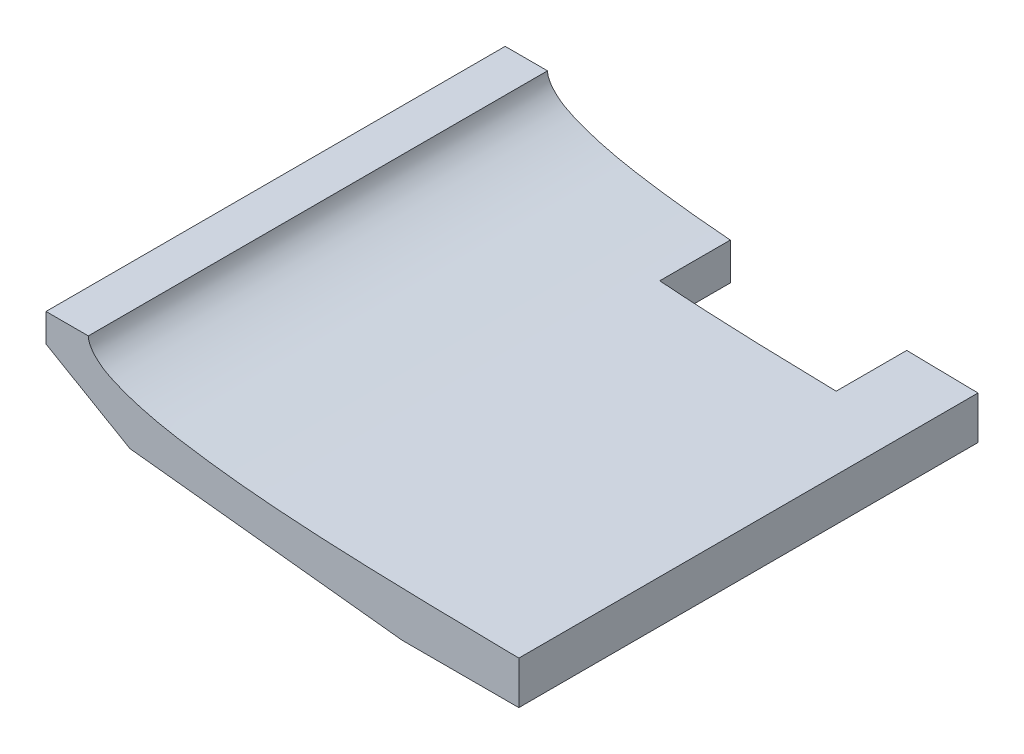
ISO-10303-21;
HEADER;
FILE_DESCRIPTION(('STEP AP214'),'2;1');
FILE_NAME('part.step','',(''),(''),'','','');
FILE_SCHEMA(('AUTOMOTIVE_DESIGN { 1 0 10303 214 1 1 1 1 }'));
ENDSEC;
DATA;
#1=APPLICATION_CONTEXT('core data for automotive mechanical design processes');
#2=APPLICATION_PROTOCOL_DEFINITION('international standard','automotive_design',2000,#1);
#3=PRODUCT_CONTEXT('',#1,'mechanical');
#4=PRODUCT('Part','Part','',(#3));
#5=PRODUCT_RELATED_PRODUCT_CATEGORY('part','',(#4));
#6=PRODUCT_DEFINITION_FORMATION('','',#4);
#7=PRODUCT_DEFINITION_CONTEXT('part definition',#1,'design');
#8=PRODUCT_DEFINITION('design','',#6,#7);
#9=PRODUCT_DEFINITION_SHAPE('','',#8);
#10=(LENGTH_UNIT() NAMED_UNIT(*) SI_UNIT(.MILLI.,.METRE.));
#11=(NAMED_UNIT(*) PLANE_ANGLE_UNIT() SI_UNIT($,.RADIAN.));
#12=(NAMED_UNIT(*) SI_UNIT($,.STERADIAN.) SOLID_ANGLE_UNIT());
#13=UNCERTAINTY_MEASURE_WITH_UNIT(LENGTH_MEASURE(1.E-05),#10,'distance_accuracy_value','');
#14=(GEOMETRIC_REPRESENTATION_CONTEXT(3) GLOBAL_UNCERTAINTY_ASSIGNED_CONTEXT((#13)) GLOBAL_UNIT_ASSIGNED_CONTEXT((#10,
#11,#12)) REPRESENTATION_CONTEXT('',''));
#15=CARTESIAN_POINT('',(0.,0.,0.));
#16=DIRECTION('',(0.,0.,1.));
#17=DIRECTION('',(1.,0.,0.));
#18=AXIS2_PLACEMENT_3D('',#15,#16,#17);
#19=CARTESIAN_POINT('',(0.,0.,-205.14));
#20=DIRECTION('',(0.,0.,1.));
#21=DIRECTION('',(1.,0.,0.));
#22=AXIS2_PLACEMENT_3D('',#19,#20,#21);
#23=PLANE('',#22);
#24=DIRECTION('',(-1.,0.,0.));
#25=VECTOR('',#24,1.);
#26=CARTESIAN_POINT('',(148.930235791546,-23.8936602432745,-205.14));
#27=LINE('',#26,#25);
#28=CARTESIAN_POINT('',(122.012987748225,-23.8936602432745,-205.139999999972));
#29=VERTEX_POINT('',#28);
#30=CARTESIAN_POINT('',(88.9302357915457,-23.8936602432745,-205.14));
#31=VERTEX_POINT('',#30);
#32=EDGE_CURVE('E152',#29,#31,#27,.T.);
#33=ORIENTED_EDGE('',*,*,#32,.F.);
#34=DIRECTION('',(0.,-1.,0.));
#35=VECTOR('',#34,1.);
#36=CARTESIAN_POINT('',(122.012987748225,0.,-205.14));
#37=LINE('',#36,#35);
#38=CARTESIAN_POINT('',(122.012987748225,-11.727641338036,-205.139999999972));
#39=VERTEX_POINT('',#38);
#40=EDGE_CURVE('E149',#39,#29,#37,.T.);
#41=ORIENTED_EDGE('',*,*,#40,.F.);
#42=CARTESIAN_POINT('',(222.012987748224,-11.2872773614074,-205.14));
#43=CARTESIAN_POINT('',(218.919378665289,-11.3223973767478,-205.14));
#44=CARTESIAN_POINT('',(205.647401932604,-11.467959012407,-205.14));
#45=CARTESIAN_POINT('',(182.199512526804,-11.713706477298,-205.14));
#46=CARTESIAN_POINT('',(151.674497926263,-11.9621131380845,-205.14));
#47=CARTESIAN_POINT('',(121.162418160369,-11.7895754768441,-205.14));
#48=CARTESIAN_POINT('',(95.7513309345537,-11.2827016840826,-205.14));
#49=CARTESIAN_POINT('',(75.4345455748465,-10.6804028674471,-205.14));
#50=CARTESIAN_POINT('',(60.2097930463776,-9.94096056040862,-205.14));
#51=CARTESIAN_POINT('',(44.9946268760517,-8.80564765903787,-205.14));
#52=CARTESIAN_POINT('',(32.3529914161165,-7.2837069255278,-205.14));
#53=CARTESIAN_POINT('',(22.2477539606058,-5.63338955843548,-205.14));
#54=CARTESIAN_POINT('',(14.6666085762918,-3.9200239548407,-205.14));
#55=CARTESIAN_POINT('',(8.28802407863243,-1.74749382065163,-205.14));
#56=CARTESIAN_POINT('',(2.90931259967548,0.956364700460667,-205.14));
#57=CARTESIAN_POINT('',(-1.89672620175331,6.52309669841284,-205.14));
#58=CARTESIAN_POINT('',(3.30662672053229,12.3039979945625,-205.14));
#59=CARTESIAN_POINT('',(9.09601436595202,15.5028984571257,-205.14));
#60=CARTESIAN_POINT('',(15.7472415942778,18.0443175722951,-205.14));
#61=CARTESIAN_POINT('',(23.5496671131226,20.117144312983,-205.14));
#62=CARTESIAN_POINT('',(33.8131815469566,22.3100945885303,-205.14));
#63=CARTESIAN_POINT('',(46.6352298566183,24.0543554633795,-205.14));
#64=CARTESIAN_POINT('',(61.9933352536892,25.2148612571156,-205.14));
#65=CARTESIAN_POINT('',(77.2950113671835,25.6577224294329,-205.14));
#66=CARTESIAN_POINT('',(97.6391657162876,25.4475340689814,-205.14));
#67=CARTESIAN_POINT('',(123.024226631959,23.8278748307742,-205.14));
#68=CARTESIAN_POINT('',(153.375544596371,20.4498563865987,-205.14));
#69=CARTESIAN_POINT('',(183.689332827867,16.2123042667402,-205.14));
#70=CARTESIAN_POINT('',(206.541071450016,12.2763423304222,-205.14));
#71=CARTESIAN_POINT('',(219.305332632429,9.88286237214647,-205.14));
#72=CARTESIAN_POINT('',(222.012987748224,9.36643436036431,-205.14));
#73=B_SPLINE_CURVE_WITH_KNOTS('',3,(#42,#43,#44,#45,#46,#47,#48,#49,#50,#51,#52,#53,#54,#55,#56,
#57,#58,#59,#60,#61,#62,#63,#64,#65,#66,#67,#68,#69,#70,#71,#72),.UNSPECIFIED.,.F.,.F.,(4,1,1,1,
1,1,1,1,1,1,1,1,1,1,1,1,1,1,1,1,1,1,1,1,1,1,1,1,4),(0.135902519716628,0.150834774390607,
0.199963506565112,0.249080491590112,0.298166920869625,0.347226598260492,0.371748790283378,
0.39626612837323,0.42079170287225,0.445368985882971,0.457709830972341,0.470165482504991,
0.482949879419857,0.489791740716257,0.49994201682548,0.512136749797248,0.519521461450315,
0.532994464684655,0.545911051204923,0.558602295103549,0.583586074296184,0.608309666465215,
0.632909244550233,0.657448148326611,0.706484295518651,0.755595699663312,0.804819773504179,
0.854194550210178,0.867498350403516),.UNSPECIFIED.);
#74=CARTESIAN_POINT('',(0.000798183001934805,6.34990742723156,-205.14));
#75=VERTEX_POINT('',#74);
#76=EDGE_CURVE('E147',#75,#39,#73,.F.);
#77=ORIENTED_EDGE('',*,*,#76,.F.);
#78=DIRECTION('',(-1.,0.,0.));
#79=VECTOR('',#78,1.);
#80=CARTESIAN_POINT('',(-11.9992018169981,6.34990742723155,-205.14));
#81=LINE('',#80,#79);
#82=CARTESIAN_POINT('',(-11.9992018169981,6.34990742723155,-205.14));
#83=VERTEX_POINT('',#82);
#84=EDGE_CURVE('E128',#75,#83,#81,.T.);
#85=ORIENTED_EDGE('',*,*,#84,.T.);
#86=DIRECTION('',(0.,1.,0.));
#87=VECTOR('',#86,1.);
#88=CARTESIAN_POINT('',(-11.9992018169981,6.34990742723155,-205.14));
#89=LINE('',#88,#87);
#90=CARTESIAN_POINT('',(-11.9992018169981,-1.65009257276845,-205.14));
#91=VERTEX_POINT('',#90);
#92=EDGE_CURVE('E136',#91,#83,#89,.T.);
#93=ORIENTED_EDGE('',*,*,#92,.F.);
#94=DIRECTION('',(-0.865252469584672,0.501336377971545,0.));
#95=VECTOR('',#94,1.);
#96=CARTESIAN_POINT('',(-11.9992018169981,-1.65009257276845,-205.14));
#97=LINE('',#96,#95);
#98=CARTESIAN_POINT('',(11.7824923751169,-15.4294562237324,-205.14));
#99=VERTEX_POINT('',#98);
#100=EDGE_CURVE('E143',#99,#91,#97,.T.);
#101=ORIENTED_EDGE('',*,*,#100,.F.);
#102=DIRECTION('',(-0.99403519167725,0.10905978959806,0.));
#103=VECTOR('',#102,1.);
#104=CARTESIAN_POINT('',(88.9302357915457,-23.8936602432745,-205.14));
#105=LINE('',#104,#103);
#106=EDGE_CURVE('E211',#31,#99,#105,.T.);
#107=ORIENTED_EDGE('',*,*,#106,.F.);
#108=EDGE_LOOP('',(#33,#41,#77,#85,#93,#101,#107));
#109=FACE_BOUND('',#108,.T.);
#110=ADVANCED_FACE('F40',(#109),#23,.T.);
#111=CARTESIAN_POINT('',(122.012987748225,0.,0.));
#112=DIRECTION('',(1.,0.,0.));
#113=DIRECTION('',(0.,0.,-1.));
#114=AXIS2_PLACEMENT_3D('',#111,#112,#113);
#115=PLANE('',#114);
#116=DIRECTION('',(0.,0.,1.));
#117=VECTOR('',#116,1.);
#118=CARTESIAN_POINT('',(122.012987748225,-23.8936602432745,-577.230552036248));
#119=LINE('',#118,#117);
#120=CARTESIAN_POINT('',(122.012987748225,-23.8936602432745,-335.28));
#121=VERTEX_POINT('',#120);
#122=EDGE_CURVE('E216',#121,#29,#119,.T.);
#123=ORIENTED_EDGE('',*,*,#122,.F.);
#124=DIRECTION('',(0.,-1.,0.));
#125=VECTOR('',#124,1.);
#126=CARTESIAN_POINT('',(122.012987748225,0.,-335.28));
#127=LINE('',#126,#125);
#128=CARTESIAN_POINT('',(122.012987748225,-11.727641338036,-335.28));
#129=VERTEX_POINT('',#128);
#130=EDGE_CURVE('E148',#129,#121,#127,.T.);
#131=ORIENTED_EDGE('',*,*,#130,.F.);
#132=DIRECTION('',(0.,0.,1.));
#133=VECTOR('',#132,1.);
#134=CARTESIAN_POINT('',(122.012987748225,-11.727641338036,-205.14));
#135=LINE('',#134,#133);
#136=EDGE_CURVE('E208',#39,#129,#135,.F.);
#137=ORIENTED_EDGE('',*,*,#136,.F.);
#138=ORIENTED_EDGE('',*,*,#40,.T.);
#139=EDGE_LOOP('',(#123,#131,#137,#138));
#140=FACE_BOUND('',#139,.T.);
#141=ADVANCED_FACE('F232',(#140),#115,.T.);
#142=CARTESIAN_POINT('',(148.930235791546,-23.8936602432745,-577.230552036248));
#143=DIRECTION('',(0.,-1.,0.));
#144=DIRECTION('',(0.,0.,-1.));
#145=AXIS2_PLACEMENT_3D('',#142,#143,#144);
#146=PLANE('',#145);
#147=ORIENTED_EDGE('',*,*,#122,.T.);
#148=ORIENTED_EDGE('',*,*,#32,.T.);
#149=DIRECTION('',(0.,0.,1.));
#150=VECTOR('',#149,1.);
#151=CARTESIAN_POINT('',(88.9302357915457,-23.8936602432745,-577.230552036248));
#152=LINE('',#151,#150);
#153=CARTESIAN_POINT('',(88.9302357915457,-23.8936602432745,-315.279999999985));
#154=VERTEX_POINT('',#153);
#155=EDGE_CURVE('E159',#154,#31,#152,.T.);
#156=ORIENTED_EDGE('',*,*,#155,.F.);
#157=DIRECTION('',(1.,0.,0.));
#158=VECTOR('',#157,1.);
#159=CARTESIAN_POINT('',(148.930235791546,-23.8936602432745,-315.279999999985));
#160=LINE('',#159,#158);
#161=CARTESIAN_POINT('',(101.81078010371,-23.8936602432745,-315.279999999985));
#162=VERTEX_POINT('',#161);
#163=EDGE_CURVE('E195',#154,#162,#160,.T.);
#164=ORIENTED_EDGE('',*,*,#163,.T.);
#165=DIRECTION('',(0.,0.,1.));
#166=VECTOR('',#165,1.);
#167=CARTESIAN_POINT('',(101.81078010371,-23.8936602432745,-577.230552036248));
#168=LINE('',#167,#166);
#169=CARTESIAN_POINT('',(101.81078010371,-23.8936602432745,-335.28));
#170=VERTEX_POINT('',#169);
#171=EDGE_CURVE('E142',#170,#162,#168,.T.);
#172=ORIENTED_EDGE('',*,*,#171,.F.);
#173=DIRECTION('',(1.,0.,0.));
#174=VECTOR('',#173,1.);
#175=CARTESIAN_POINT('',(148.930235791546,-23.8936602432745,-335.28));
#176=LINE('',#175,#174);
#177=EDGE_CURVE('E163',#170,#121,#176,.T.);
#178=ORIENTED_EDGE('',*,*,#177,.T.);
#179=EDGE_LOOP('',(#147,#148,#156,#164,#172,#178));
#180=FACE_BOUND('',#179,.T.);
#181=ADVANCED_FACE('F245',(#180),#146,.T.);
#182=CARTESIAN_POINT('',(51.8107801037102,-18.1594098063785,-315.28));
#183=DIRECTION('',(-1.,0.,0.));
#184=DIRECTION('',(0.,0.,1.));
#185=AXIS2_PLACEMENT_3D('',#182,#183,#184);
#186=PLANE('',#185);
#187=DIRECTION('',(0.,0.,1.));
#188=VECTOR('',#187,1.);
#189=CARTESIAN_POINT('',(51.8107801037102,-9.28886109713478,-205.14));
#190=LINE('',#189,#188);
#191=CARTESIAN_POINT('',(51.8107801037102,-9.28886109713478,-335.28));
#192=VERTEX_POINT('',#191);
#193=CARTESIAN_POINT('',(51.8107801037102,-9.28886109713478,-315.279999999985));
#194=VERTEX_POINT('',#193);
#195=EDGE_CURVE('E59',#192,#194,#190,.T.);
#196=ORIENTED_EDGE('',*,*,#195,.T.);
#197=DIRECTION('',(0.,1.,0.));
#198=VECTOR('',#197,1.);
#199=CARTESIAN_POINT('',(51.8107801037102,56.8346247025372,-315.279999999985));
#200=LINE('',#199,#198);
#201=CARTESIAN_POINT('',(51.8107801037102,-19.821128343796,-315.279999999985));
#202=VERTEX_POINT('',#201);
#203=EDGE_CURVE('E202',#202,#194,#200,.T.);
#204=ORIENTED_EDGE('',*,*,#203,.F.);
#205=DIRECTION('',(0.,0.,-1.));
#206=VECTOR('',#205,1.);
#207=CARTESIAN_POINT('',(51.8107801037102,-19.821128343796,-577.230552036248));
#208=LINE('',#207,#206);
#209=CARTESIAN_POINT('',(51.8107801037102,-19.821128343796,-335.28));
#210=VERTEX_POINT('',#209);
#211=EDGE_CURVE('E174',#202,#210,#208,.T.);
#212=ORIENTED_EDGE('',*,*,#211,.T.);
#213=DIRECTION('',(0.,-1.,0.));
#214=VECTOR('',#213,1.);
#215=CARTESIAN_POINT('',(51.8107801037102,-43.1653752974628,-335.28));
#216=LINE('',#215,#214);
#217=EDGE_CURVE('E64',#192,#210,#216,.T.);
#218=ORIENTED_EDGE('',*,*,#217,.F.);
#219=EDGE_LOOP('',(#196,#204,#212,#218));
#220=FACE_BOUND('',#219,.T.);
#221=ADVANCED_FACE('F260',(#220),#186,.F.);
#222=CARTESIAN_POINT('',(-50.1696101681485,56.8346247025372,-315.279999999985));
#223=DIRECTION('',(0.,0.,-1.));
#224=DIRECTION('',(0.,1.,0.));
#225=AXIS2_PLACEMENT_3D('',#222,#223,#224);
#226=PLANE('',#225);
#227=DIRECTION('',(0.,1.,0.));
#228=VECTOR('',#227,1.);
#229=CARTESIAN_POINT('',(101.81078010371,56.8346247025372,-315.279999999985));
#230=LINE('',#229,#228);
#231=CARTESIAN_POINT('',(101.81078010371,-11.3832380593149,-315.279999999985));
#232=VERTEX_POINT('',#231);
#233=EDGE_CURVE('E51',#162,#232,#230,.T.);
#234=ORIENTED_EDGE('',*,*,#233,.F.);
#235=ORIENTED_EDGE('',*,*,#163,.F.);
#236=DIRECTION('',(0.99403519167725,-0.10905978959806,0.));
#237=VECTOR('',#236,1.);
#238=CARTESIAN_POINT('',(88.9302357915456,-23.8936602432745,-315.279999999985));
#239=LINE('',#238,#237);
#240=EDGE_CURVE('E176',#202,#154,#239,.T.);
#241=ORIENTED_EDGE('',*,*,#240,.F.);
#242=ORIENTED_EDGE('',*,*,#203,.T.);
#243=CARTESIAN_POINT('',(222.012987748224,-11.2872773614074,-315.279999999985));
#244=CARTESIAN_POINT('',(218.919378665289,-11.3223973767478,-315.279999999985));
#245=CARTESIAN_POINT('',(205.647401932604,-11.467959012407,-315.279999999985));
#246=CARTESIAN_POINT('',(182.199512526804,-11.713706477298,-315.279999999985));
#247=CARTESIAN_POINT('',(151.674497926263,-11.9621131380845,-315.279999999985));
#248=CARTESIAN_POINT('',(121.162418160369,-11.7895754768441,-315.279999999985));
#249=CARTESIAN_POINT('',(95.7513309345537,-11.2827016840826,-315.279999999985));
#250=CARTESIAN_POINT('',(75.4345455748465,-10.6804028674471,-315.279999999985));
#251=CARTESIAN_POINT('',(60.2097930463776,-9.94096056040862,-315.279999999985));
#252=CARTESIAN_POINT('',(44.9946268760517,-8.80564765903787,-315.279999999985));
#253=CARTESIAN_POINT('',(32.3529914161165,-7.2837069255278,-315.279999999985));
#254=CARTESIAN_POINT('',(22.2477539606058,-5.63338955843548,-315.279999999985));
#255=CARTESIAN_POINT('',(14.6666085762918,-3.9200239548407,-315.279999999985));
#256=CARTESIAN_POINT('',(8.28802407863243,-1.74749382065163,-315.279999999985));
#257=CARTESIAN_POINT('',(2.90931259967548,0.956364700460667,-315.279999999985));
#258=CARTESIAN_POINT('',(-1.89672620175331,6.52309669841284,-315.279999999985));
#259=CARTESIAN_POINT('',(3.30662672053229,12.3039979945625,-315.279999999985));
#260=CARTESIAN_POINT('',(9.09601436595202,15.5028984571257,-315.279999999985));
#261=CARTESIAN_POINT('',(15.7472415942778,18.0443175722951,-315.279999999985));
#262=CARTESIAN_POINT('',(23.5496671131226,20.117144312983,-315.279999999985));
#263=CARTESIAN_POINT('',(33.8131815469566,22.3100945885303,-315.279999999985));
#264=CARTESIAN_POINT('',(46.6352298566183,24.0543554633795,-315.279999999985));
#265=CARTESIAN_POINT('',(61.9933352536892,25.2148612571156,-315.279999999985));
#266=CARTESIAN_POINT('',(77.2950113671835,25.6577224294329,-315.279999999985));
#267=CARTESIAN_POINT('',(97.6391657162876,25.4475340689814,-315.279999999985));
#268=CARTESIAN_POINT('',(123.024226631959,23.8278748307742,-315.279999999985));
#269=CARTESIAN_POINT('',(153.375544596371,20.4498563865987,-315.279999999985));
#270=CARTESIAN_POINT('',(183.689332827867,16.2123042667402,-315.279999999985));
#271=CARTESIAN_POINT('',(206.541071450016,12.2763423304222,-315.279999999985));
#272=CARTESIAN_POINT('',(219.305332632429,9.88286237214647,-315.279999999985));
#273=CARTESIAN_POINT('',(222.012987748224,9.36643436036431,-315.279999999985));
#274=B_SPLINE_CURVE_WITH_KNOTS('',3,(#243,#244,#245,#246,#247,#248,#249,#250,#251,#252,#253,
#254,#255,#256,#257,#258,#259,#260,#261,#262,#263,#264,#265,#266,#267,#268,#269,#270,#271,#272,
#273),.UNSPECIFIED.,.F.,.F.,(4,1,1,1,1,1,1,1,1,1,1,1,1,1,1,1,1,1,1,1,1,1,1,1,1,1,1,1,4),
(0.135902519716628,0.150834774390607,0.199963506565112,0.249080491590112,0.298166920869625,
0.347226598260492,0.371748790283378,0.39626612837323,0.42079170287225,0.445368985882971,
0.457709830972341,0.470165482504991,0.482949879419857,0.489791740716257,0.49994201682548,
0.512136749797248,0.519521461450315,0.532994464684655,0.545911051204923,0.558602295103549,
0.583586074296184,0.608309666465215,0.632909244550233,0.657448148326611,0.706484295518651,
0.755595699663312,0.804819773504179,0.854194550210178,0.867498350403516),.UNSPECIFIED.);
#275=EDGE_CURVE('E190',#232,#194,#274,.T.);
#276=ORIENTED_EDGE('',*,*,#275,.F.);
#277=EDGE_LOOP('',(#234,#235,#241,#242,#276));
#278=FACE_BOUND('',#277,.T.);
#279=ADVANCED_FACE('F251',(#278),#226,.T.);
#280=CARTESIAN_POINT('',(101.81078010371,0.,0.));
#281=DIRECTION('',(1.,0.,0.));
#282=DIRECTION('',(0.,0.,-1.));
#283=AXIS2_PLACEMENT_3D('',#280,#281,#282);
#284=PLANE('',#283);
#285=DIRECTION('',(0.,0.,1.));
#286=VECTOR('',#285,1.);
#287=CARTESIAN_POINT('',(101.81078010371,-11.3832380593149,-205.14));
#288=LINE('',#287,#286);
#289=CARTESIAN_POINT('',(101.81078010371,-11.3832380593149,-335.28));
#290=VERTEX_POINT('',#289);
#291=EDGE_CURVE('E183',#232,#290,#288,.F.);
#292=ORIENTED_EDGE('',*,*,#291,.T.);
#293=DIRECTION('',(0.,-1.,0.));
#294=VECTOR('',#293,1.);
#295=CARTESIAN_POINT('',(101.81078010371,-43.1653752974628,-335.28));
#296=LINE('',#295,#294);
#297=EDGE_CURVE('E12',#290,#170,#296,.T.);
#298=ORIENTED_EDGE('',*,*,#297,.T.);
#299=ORIENTED_EDGE('',*,*,#171,.T.);
#300=ORIENTED_EDGE('',*,*,#233,.T.);
#301=EDGE_LOOP('',(#292,#298,#299,#300));
#302=FACE_BOUND('',#301,.T.);
#303=ADVANCED_FACE('F249',(#302),#284,.F.);
#304=CARTESIAN_POINT('',(0.,0.,-335.28));
#305=DIRECTION('',(0.,0.,-1.));
#306=DIRECTION('',(-1.,0.,0.));
#307=AXIS2_PLACEMENT_3D('',#304,#305,#306);
#308=PLANE('',#307);
#309=CARTESIAN_POINT('',(222.012987748224,-11.2872773614074,-335.28));
#310=CARTESIAN_POINT('',(218.919378665289,-11.3223973767478,-335.28));
#311=CARTESIAN_POINT('',(205.647401932604,-11.467959012407,-335.28));
#312=CARTESIAN_POINT('',(182.199512526804,-11.713706477298,-335.28));
#313=CARTESIAN_POINT('',(151.674497926263,-11.9621131380845,-335.28));
#314=CARTESIAN_POINT('',(121.162418160369,-11.7895754768441,-335.28));
#315=CARTESIAN_POINT('',(95.7513309345537,-11.2827016840826,-335.28));
#316=CARTESIAN_POINT('',(75.4345455748465,-10.6804028674471,-335.28));
#317=CARTESIAN_POINT('',(60.2097930463776,-9.94096056040862,-335.28));
#318=CARTESIAN_POINT('',(44.9946268760517,-8.80564765903787,-335.28));
#319=CARTESIAN_POINT('',(32.3529914161165,-7.2837069255278,-335.28));
#320=CARTESIAN_POINT('',(22.2477539606058,-5.63338955843548,-335.28));
#321=CARTESIAN_POINT('',(14.6666085762918,-3.9200239548407,-335.28));
#322=CARTESIAN_POINT('',(8.28802407863243,-1.74749382065163,-335.28));
#323=CARTESIAN_POINT('',(2.90931259967548,0.956364700460667,-335.28));
#324=CARTESIAN_POINT('',(-1.89672620175331,6.52309669841284,-335.28));
#325=CARTESIAN_POINT('',(3.30662672053229,12.3039979945625,-335.28));
#326=CARTESIAN_POINT('',(9.09601436595202,15.5028984571257,-335.28));
#327=CARTESIAN_POINT('',(15.7472415942778,18.0443175722951,-335.28));
#328=CARTESIAN_POINT('',(23.5496671131226,20.117144312983,-335.28));
#329=CARTESIAN_POINT('',(33.8131815469566,22.3100945885303,-335.28));
#330=CARTESIAN_POINT('',(46.6352298566183,24.0543554633795,-335.28));
#331=CARTESIAN_POINT('',(61.9933352536892,25.2148612571156,-335.28));
#332=CARTESIAN_POINT('',(77.2950113671835,25.6577224294329,-335.28));
#333=CARTESIAN_POINT('',(97.6391657162876,25.4475340689814,-335.28));
#334=CARTESIAN_POINT('',(123.024226631959,23.8278748307742,-335.28));
#335=CARTESIAN_POINT('',(153.375544596371,20.4498563865987,-335.28));
#336=CARTESIAN_POINT('',(183.689332827867,16.2123042667402,-335.28));
#337=CARTESIAN_POINT('',(206.541071450016,12.2763423304222,-335.28));
#338=CARTESIAN_POINT('',(219.305332632429,9.88286237214647,-335.28));
#339=CARTESIAN_POINT('',(222.012987748224,9.36643436036431,-335.28));
#340=B_SPLINE_CURVE_WITH_KNOTS('',3,(#309,#310,#311,#312,#313,#314,#315,#316,#317,#318,#319,
#320,#321,#322,#323,#324,#325,#326,#327,#328,#329,#330,#331,#332,#333,#334,#335,#336,#337,#338,
#339),.UNSPECIFIED.,.F.,.F.,(4,1,1,1,1,1,1,1,1,1,1,1,1,1,1,1,1,1,1,1,1,1,1,1,1,1,1,1,4),
(0.135902519716628,0.150834774390607,0.199963506565112,0.249080491590112,0.298166920869625,
0.347226598260492,0.371748790283378,0.39626612837323,0.42079170287225,0.445368985882971,
0.457709830972341,0.470165482504991,0.482949879419857,0.489791740716257,0.49994201682548,
0.512136749797248,0.519521461450315,0.532994464684655,0.545911051204923,0.558602295103549,
0.583586074296184,0.608309666465215,0.632909244550233,0.657448148326611,0.706484295518651,
0.755595699663312,0.804819773504179,0.854194550210178,0.867498350403516),.UNSPECIFIED.);
#341=EDGE_CURVE('E181',#129,#290,#340,.T.);
#342=ORIENTED_EDGE('',*,*,#341,.F.);
#343=ORIENTED_EDGE('',*,*,#130,.T.);
#344=ORIENTED_EDGE('',*,*,#177,.F.);
#345=ORIENTED_EDGE('',*,*,#297,.F.);
#346=EDGE_LOOP('',(#342,#343,#344,#345));
#347=FACE_BOUND('',#346,.T.);
#348=ADVANCED_FACE('F236',(#347),#308,.T.);
#349=CARTESIAN_POINT('',(88.9302357915457,-23.8936602432745,-577.230552036248));
#350=DIRECTION('',(-0.10905978959806,-0.99403519167725,0.));
#351=DIRECTION('',(0.99403519167725,-0.10905978959806,0.));
#352=AXIS2_PLACEMENT_3D('',#349,#350,#351);
#353=PLANE('',#352);
#354=ORIENTED_EDGE('',*,*,#155,.T.);
#355=ORIENTED_EDGE('',*,*,#106,.T.);
#356=DIRECTION('',(0.,0.,1.));
#357=VECTOR('',#356,1.);
#358=CARTESIAN_POINT('',(11.7824923751169,-15.4294562237324,-577.230552036248));
#359=LINE('',#358,#357);
#360=CARTESIAN_POINT('',(11.7824923751169,-15.4294562237324,-335.28));
#361=VERTEX_POINT('',#360);
#362=EDGE_CURVE('E164',#361,#99,#359,.T.);
#363=ORIENTED_EDGE('',*,*,#362,.F.);
#364=DIRECTION('',(0.99403519167725,-0.10905978959806,0.));
#365=VECTOR('',#364,1.);
#366=CARTESIAN_POINT('',(88.9302357915457,-23.8936602432745,-335.28));
#367=LINE('',#366,#365);
#368=EDGE_CURVE('E162',#361,#210,#367,.T.);
#369=ORIENTED_EDGE('',*,*,#368,.T.);
#370=ORIENTED_EDGE('',*,*,#211,.F.);
#371=ORIENTED_EDGE('',*,*,#240,.T.);
#372=EDGE_LOOP('',(#354,#355,#363,#369,#370,#371));
#373=FACE_BOUND('',#372,.T.);
#374=ADVANCED_FACE('F258',(#373),#353,.T.);
#375=CARTESIAN_POINT('',(-11.9992018169981,-1.65009257276845,-577.230552036248));
#376=DIRECTION('',(-0.501336377971545,-0.865252469584672,0.));
#377=DIRECTION('',(0.865252469584672,-0.501336377971545,0.));
#378=AXIS2_PLACEMENT_3D('',#375,#376,#377);
#379=PLANE('',#378);
#380=ORIENTED_EDGE('',*,*,#362,.T.);
#381=ORIENTED_EDGE('',*,*,#100,.T.);
#382=DIRECTION('',(0.,0.,1.));
#383=VECTOR('',#382,1.);
#384=CARTESIAN_POINT('',(-11.9992018169981,-1.65009257276845,-577.230552036248));
#385=LINE('',#384,#383);
#386=CARTESIAN_POINT('',(-11.9992018169981,-1.65009257276845,-335.28));
#387=VERTEX_POINT('',#386);
#388=EDGE_CURVE('E139',#387,#91,#385,.T.);
#389=ORIENTED_EDGE('',*,*,#388,.F.);
#390=DIRECTION('',(0.865252469584672,-0.501336377971545,0.));
#391=VECTOR('',#390,1.);
#392=CARTESIAN_POINT('',(-11.9992018169981,-1.65009257276845,-335.28));
#393=LINE('',#392,#391);
#394=EDGE_CURVE('E167',#387,#361,#393,.T.);
#395=ORIENTED_EDGE('',*,*,#394,.T.);
#396=EDGE_LOOP('',(#380,#381,#389,#395));
#397=FACE_BOUND('',#396,.T.);
#398=ADVANCED_FACE('F257',(#397),#379,.T.);
#399=CARTESIAN_POINT('',(-11.9992018169981,6.34990742723155,-577.230552036248));
#400=DIRECTION('',(-1.,0.,0.));
#401=DIRECTION('',(0.,-1.,0.));
#402=AXIS2_PLACEMENT_3D('',#399,#400,#401);
#403=PLANE('',#402);
#404=ORIENTED_EDGE('',*,*,#388,.T.);
#405=ORIENTED_EDGE('',*,*,#92,.T.);
#406=DIRECTION('',(0.,0.,1.));
#407=VECTOR('',#406,1.);
#408=CARTESIAN_POINT('',(-11.9992018169981,6.34990742723155,-577.230552036248));
#409=LINE('',#408,#407);
#410=CARTESIAN_POINT('',(-11.9992018169981,6.34990742723155,-335.28));
#411=VERTEX_POINT('',#410);
#412=EDGE_CURVE('E124',#411,#83,#409,.T.);
#413=ORIENTED_EDGE('',*,*,#412,.F.);
#414=DIRECTION('',(0.,-1.,0.));
#415=VECTOR('',#414,1.);
#416=CARTESIAN_POINT('',(-11.9992018169981,6.34990742723155,-335.28));
#417=LINE('',#416,#415);
#418=EDGE_CURVE('E169',#411,#387,#417,.T.);
#419=ORIENTED_EDGE('',*,*,#418,.T.);
#420=EDGE_LOOP('',(#404,#405,#413,#419));
#421=FACE_BOUND('',#420,.T.);
#422=ADVANCED_FACE('F137',(#421),#403,.T.);
#423=ORIENTED_EDGE('',*,*,#217,.T.);
#424=ORIENTED_EDGE('',*,*,#368,.F.);
#425=ORIENTED_EDGE('',*,*,#394,.F.);
#426=ORIENTED_EDGE('',*,*,#418,.F.);
#427=DIRECTION('',(-1.,0.,0.));
#428=VECTOR('',#427,1.);
#429=CARTESIAN_POINT('',(0.,6.34990742723155,-335.28));
#430=LINE('',#429,#428);
#431=CARTESIAN_POINT('',(0.000798183001934805,6.34990742723156,-335.28));
#432=VERTEX_POINT('',#431);
#433=EDGE_CURVE('E130',#432,#411,#430,.T.);
#434=ORIENTED_EDGE('',*,*,#433,.F.);
#435=EDGE_CURVE('E237',#192,#432,#340,.T.);
#436=ORIENTED_EDGE('',*,*,#435,.F.);
#437=EDGE_LOOP('',(#423,#424,#425,#426,#434,#436));
#438=FACE_BOUND('',#437,.T.);
#439=ADVANCED_FACE('F42',(#438),#308,.T.);
#440=CARTESIAN_POINT('',(222.012987748224,-11.2872773614074,-577.230552036248));
#441=CARTESIAN_POINT('',(218.919378665289,-11.3223973767478,-577.230552036248));
#442=CARTESIAN_POINT('',(205.647401932604,-11.467959012407,-577.230552036248));
#443=CARTESIAN_POINT('',(182.199512526804,-11.713706477298,-577.230552036248));
#444=CARTESIAN_POINT('',(151.674497926263,-11.9621131380845,-577.230552036248));
#445=CARTESIAN_POINT('',(121.162418160369,-11.7895754768441,-577.230552036248));
#446=CARTESIAN_POINT('',(95.7513309345537,-11.2827016840826,-577.230552036248));
#447=CARTESIAN_POINT('',(75.4345455748465,-10.6804028674471,-577.230552036248));
#448=CARTESIAN_POINT('',(60.2097930463776,-9.94096056040862,-577.230552036248));
#449=CARTESIAN_POINT('',(44.9946268760517,-8.80564765903787,-577.230552036248));
#450=CARTESIAN_POINT('',(32.3529914161165,-7.2837069255278,-577.230552036248));
#451=CARTESIAN_POINT('',(22.2477539606058,-5.63338955843548,-577.230552036248));
#452=CARTESIAN_POINT('',(14.6666085762918,-3.9200239548407,-577.230552036248));
#453=CARTESIAN_POINT('',(8.28802407863243,-1.74749382065163,-577.230552036248));
#454=CARTESIAN_POINT('',(2.90931259967548,0.956364700460667,-577.230552036248));
#455=CARTESIAN_POINT('',(-1.89672620175331,6.52309669841284,-577.230552036248));
#456=CARTESIAN_POINT('',(3.30662672053229,12.3039979945625,-577.230552036248));
#457=CARTESIAN_POINT('',(9.09601436595202,15.5028984571257,-577.230552036248));
#458=CARTESIAN_POINT('',(15.7472415942778,18.0443175722951,-577.230552036248));
#459=CARTESIAN_POINT('',(23.5496671131226,20.117144312983,-577.230552036248));
#460=CARTESIAN_POINT('',(33.8131815469566,22.3100945885303,-577.230552036248));
#461=CARTESIAN_POINT('',(46.6352298566183,24.0543554633795,-577.230552036248));
#462=CARTESIAN_POINT('',(61.9933352536892,25.2148612571156,-577.230552036248));
#463=CARTESIAN_POINT('',(77.2950113671835,25.6577224294329,-577.230552036248));
#464=CARTESIAN_POINT('',(97.6391657162876,25.4475340689814,-577.230552036248));
#465=CARTESIAN_POINT('',(123.024226631959,23.8278748307742,-577.230552036248));
#466=CARTESIAN_POINT('',(153.375544596371,20.4498563865987,-577.230552036248));
#467=CARTESIAN_POINT('',(183.689332827867,16.2123042667402,-577.230552036248));
#468=CARTESIAN_POINT('',(206.541071450016,12.2763423304222,-577.230552036248));
#469=CARTESIAN_POINT('',(219.305332632429,9.88286237214647,-577.230552036248));
#470=CARTESIAN_POINT('',(222.012987748224,9.36643436036431,-577.230552036248));
#471=B_SPLINE_CURVE_WITH_KNOTS('',3,(#440,#441,#442,#443,#444,#445,#446,#447,#448,#449,#450,
#451,#452,#453,#454,#455,#456,#457,#458,#459,#460,#461,#462,#463,#464,#465,#466,#467,#468,#469,
#470),.UNSPECIFIED.,.F.,.F.,(4,1,1,1,1,1,1,1,1,1,1,1,1,1,1,1,1,1,1,1,1,1,1,1,1,1,1,1,4),
(0.135902519716628,0.150834774390607,0.199963506565112,0.249080491590112,0.298166920869625,
0.347226598260492,0.371748790283378,0.39626612837323,0.42079170287225,0.445368985882971,
0.457709830972341,0.470165482504991,0.482949879419857,0.489791740716257,0.49994201682548,
0.512136749797248,0.519521461450315,0.532994464684655,0.545911051204923,0.558602295103549,
0.583586074296184,0.608309666465215,0.632909244550233,0.657448148326611,0.706484295518651,
0.755595699663312,0.804819773504179,0.854194550210178,0.867498350403516),.UNSPECIFIED.);
#472=DIRECTION('',(0.,0.,1.));
#473=VECTOR('',#472,1.);
#474=SURFACE_OF_LINEAR_EXTRUSION('',#471,#473);
#475=DIRECTION('',(0.,0.,1.));
#476=VECTOR('',#475,1.);
#477=CARTESIAN_POINT('',(0.000798183001934805,6.34990742723156,-2.22044604925031E-13));
#478=LINE('',#477,#476);
#479=EDGE_CURVE('E133',#75,#432,#478,.F.);
#480=ORIENTED_EDGE('',*,*,#479,.F.);
#481=ORIENTED_EDGE('',*,*,#76,.T.);
#482=ORIENTED_EDGE('',*,*,#136,.T.);
#483=ORIENTED_EDGE('',*,*,#341,.T.);
#484=ORIENTED_EDGE('',*,*,#291,.F.);
#485=ORIENTED_EDGE('',*,*,#275,.T.);
#486=ORIENTED_EDGE('',*,*,#195,.F.);
#487=ORIENTED_EDGE('',*,*,#435,.T.);
#488=EDGE_LOOP('',(#480,#481,#482,#483,#484,#485,#486,#487));
#489=FACE_BOUND('',#488,.T.);
#490=ADVANCED_FACE('F228',(#489),#474,.T.);
#491=CARTESIAN_POINT('',(-11.9992018169981,6.34990742723155,335.28));
#492=DIRECTION('',(0.,-1.,0.));
#493=DIRECTION('',(1.,0.,0.));
#494=AXIS2_PLACEMENT_3D('',#491,#492,#493);
#495=PLANE('',#494);
#496=ORIENTED_EDGE('',*,*,#84,.F.);
#497=ORIENTED_EDGE('',*,*,#479,.T.);
#498=ORIENTED_EDGE('',*,*,#433,.T.);
#499=ORIENTED_EDGE('',*,*,#412,.T.);
#500=EDGE_LOOP('',(#496,#497,#498,#499));
#501=FACE_BOUND('',#500,.T.);
#502=ADVANCED_FACE('F126',(#501),#495,.F.);
#503=CLOSED_SHELL('',(#110,#141,#181,#221,#279,#303,#348,#374,#398,#422,#439,#490,#502));
#504=MANIFOLD_SOLID_BREP('B2',#503);
#505=ADVANCED_BREP_SHAPE_REPRESENTATION('',(#18,#504),#14);
#506=SHAPE_DEFINITION_REPRESENTATION(#9,#505);
ENDSEC;
END-ISO-10303-21;
